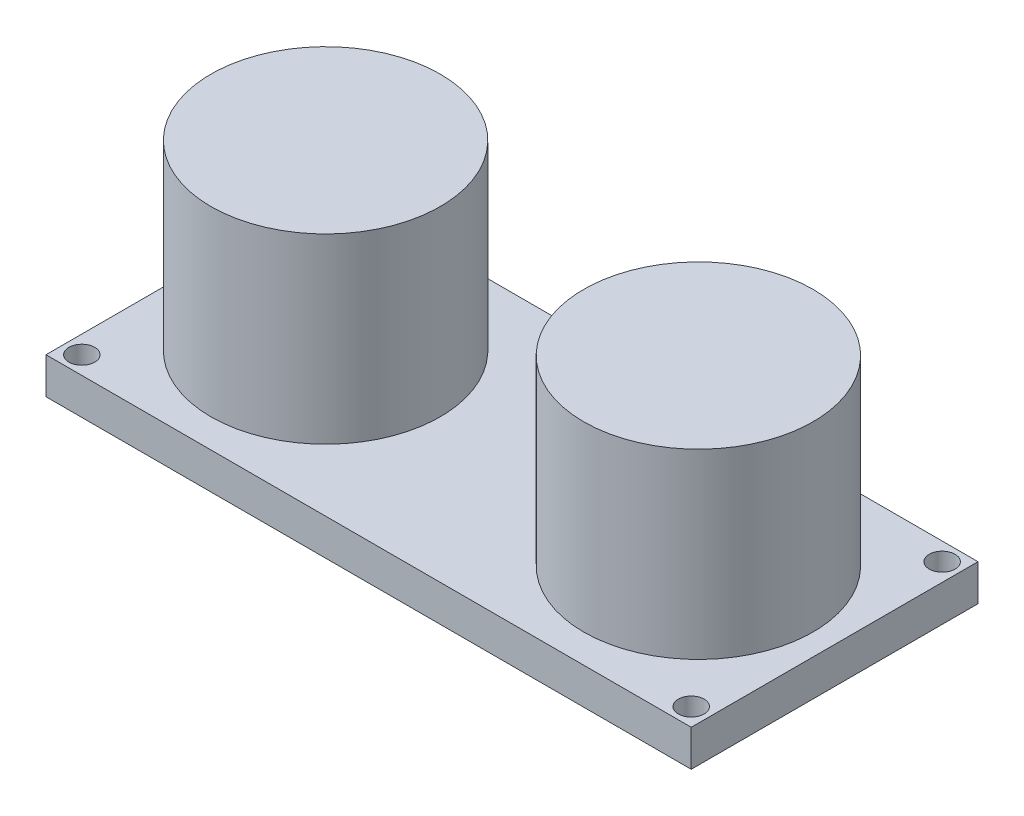
ISO-10303-21;
HEADER;
FILE_DESCRIPTION(('STEP AP214'),'2;1');
FILE_NAME('part.step','',(''),(''),'','','');
FILE_SCHEMA(('AUTOMOTIVE_DESIGN { 1 0 10303 214 1 1 1 1 }'));
ENDSEC;
DATA;
#1=APPLICATION_CONTEXT('core data for automotive mechanical design processes');
#2=APPLICATION_PROTOCOL_DEFINITION('international standard','automotive_design',2000,#1);
#3=PRODUCT_CONTEXT('',#1,'mechanical');
#4=PRODUCT('Part','Part','',(#3));
#5=PRODUCT_RELATED_PRODUCT_CATEGORY('part','',(#4));
#6=PRODUCT_DEFINITION_FORMATION('','',#4);
#7=PRODUCT_DEFINITION_CONTEXT('part definition',#1,'design');
#8=PRODUCT_DEFINITION('design','',#6,#7);
#9=PRODUCT_DEFINITION_SHAPE('','',#8);
#10=(LENGTH_UNIT() NAMED_UNIT(*) SI_UNIT(.MILLI.,.METRE.));
#11=(NAMED_UNIT(*) PLANE_ANGLE_UNIT() SI_UNIT($,.RADIAN.));
#12=(NAMED_UNIT(*) SI_UNIT($,.STERADIAN.) SOLID_ANGLE_UNIT());
#13=UNCERTAINTY_MEASURE_WITH_UNIT(LENGTH_MEASURE(1.E-05),#10,'distance_accuracy_value','');
#14=(GEOMETRIC_REPRESENTATION_CONTEXT(3) GLOBAL_UNCERTAINTY_ASSIGNED_CONTEXT((#13)) GLOBAL_UNIT_ASSIGNED_CONTEXT((#10,
#11,#12)) REPRESENTATION_CONTEXT('',''));
#15=CARTESIAN_POINT('',(0.,0.,0.));
#16=DIRECTION('',(0.,0.,1.));
#17=DIRECTION('',(1.,0.,0.));
#18=AXIS2_PLACEMENT_3D('',#15,#16,#17);
#19=CARTESIAN_POINT('',(0.,2.54,0.));
#20=DIRECTION('',(1.,0.,0.));
#21=DIRECTION('',(0.,0.,-1.));
#22=AXIS2_PLACEMENT_3D('',#19,#20,#21);
#23=PLANE('',#22);
#24=DIRECTION('',(0.,0.,1.));
#25=VECTOR('',#24,1.);
#26=CARTESIAN_POINT('',(0.,0.,0.));
#27=LINE('',#26,#25);
#28=CARTESIAN_POINT('',(0.,0.,-20.));
#29=VERTEX_POINT('',#28);
#30=CARTESIAN_POINT('',(0.,0.,0.));
#31=VERTEX_POINT('',#30);
#32=EDGE_CURVE('E111',#29,#31,#27,.T.);
#33=ORIENTED_EDGE('',*,*,#32,.T.);
#34=DIRECTION('',(0.,-1.,0.));
#35=VECTOR('',#34,1.);
#36=CARTESIAN_POINT('',(0.,2.54,0.));
#37=LINE('',#36,#35);
#38=CARTESIAN_POINT('',(0.,2.54,0.));
#39=VERTEX_POINT('',#38);
#40=EDGE_CURVE('E100',#39,#31,#37,.T.);
#41=ORIENTED_EDGE('',*,*,#40,.F.);
#42=DIRECTION('',(0.,0.,1.));
#43=VECTOR('',#42,1.);
#44=CARTESIAN_POINT('',(0.,2.54,0.));
#45=LINE('',#44,#43);
#46=CARTESIAN_POINT('',(0.,2.54,-20.));
#47=VERTEX_POINT('',#46);
#48=EDGE_CURVE('E92',#47,#39,#45,.T.);
#49=ORIENTED_EDGE('',*,*,#48,.F.);
#50=DIRECTION('',(0.,-1.,0.));
#51=VECTOR('',#50,1.);
#52=CARTESIAN_POINT('',(0.,2.54,-20.));
#53=LINE('',#52,#51);
#54=EDGE_CURVE('E107',#47,#29,#53,.T.);
#55=ORIENTED_EDGE('',*,*,#54,.T.);
#56=EDGE_LOOP('',(#33,#41,#49,#55));
#57=FACE_BOUND('',#56,.T.);
#58=ADVANCED_FACE('F39',(#57),#23,.F.);
#59=CARTESIAN_POINT('',(0.,2.54,0.));
#60=DIRECTION('',(0.,0.,-1.));
#61=DIRECTION('',(-1.,0.,0.));
#62=AXIS2_PLACEMENT_3D('',#59,#60,#61);
#63=PLANE('',#62);
#64=DIRECTION('',(1.,0.,0.));
#65=VECTOR('',#64,1.);
#66=CARTESIAN_POINT('',(0.,0.,0.));
#67=LINE('',#66,#65);
#68=CARTESIAN_POINT('',(45.,0.,0.));
#69=VERTEX_POINT('',#68);
#70=EDGE_CURVE('E98',#31,#69,#67,.T.);
#71=ORIENTED_EDGE('',*,*,#70,.T.);
#72=DIRECTION('',(0.,-1.,0.));
#73=VECTOR('',#72,1.);
#74=CARTESIAN_POINT('',(45.,2.54,0.));
#75=LINE('',#74,#73);
#76=CARTESIAN_POINT('',(45.,2.54,0.));
#77=VERTEX_POINT('',#76);
#78=EDGE_CURVE('E96',#77,#69,#75,.T.);
#79=ORIENTED_EDGE('',*,*,#78,.F.);
#80=DIRECTION('',(1.,0.,0.));
#81=VECTOR('',#80,1.);
#82=CARTESIAN_POINT('',(0.,2.54,0.));
#83=LINE('',#82,#81);
#84=EDGE_CURVE('E87',#39,#77,#83,.T.);
#85=ORIENTED_EDGE('',*,*,#84,.F.);
#86=ORIENTED_EDGE('',*,*,#40,.T.);
#87=EDGE_LOOP('',(#71,#79,#85,#86));
#88=FACE_BOUND('',#87,.T.);
#89=ADVANCED_FACE('F97',(#88),#63,.F.);
#90=CARTESIAN_POINT('',(45.,2.54,0.));
#91=DIRECTION('',(-1.,0.,0.));
#92=DIRECTION('',(0.,0.,1.));
#93=AXIS2_PLACEMENT_3D('',#90,#91,#92);
#94=PLANE('',#93);
#95=DIRECTION('',(0.,0.,-1.));
#96=VECTOR('',#95,1.);
#97=CARTESIAN_POINT('',(45.,0.,0.));
#98=LINE('',#97,#96);
#99=CARTESIAN_POINT('',(45.,0.,-20.));
#100=VERTEX_POINT('',#99);
#101=EDGE_CURVE('E73',#69,#100,#98,.T.);
#102=ORIENTED_EDGE('',*,*,#101,.T.);
#103=DIRECTION('',(0.,-1.,0.));
#104=VECTOR('',#103,1.);
#105=CARTESIAN_POINT('',(45.,2.54,-20.));
#106=LINE('',#105,#104);
#107=CARTESIAN_POINT('',(45.,2.54,-20.));
#108=VERTEX_POINT('',#107);
#109=EDGE_CURVE('E101',#108,#100,#106,.T.);
#110=ORIENTED_EDGE('',*,*,#109,.F.);
#111=DIRECTION('',(0.,0.,-1.));
#112=VECTOR('',#111,1.);
#113=CARTESIAN_POINT('',(45.,2.54,0.));
#114=LINE('',#113,#112);
#115=EDGE_CURVE('E90',#77,#108,#114,.T.);
#116=ORIENTED_EDGE('',*,*,#115,.F.);
#117=ORIENTED_EDGE('',*,*,#78,.T.);
#118=EDGE_LOOP('',(#102,#110,#116,#117));
#119=FACE_BOUND('',#118,.T.);
#120=ADVANCED_FACE('F103',(#119),#94,.F.);
#121=CARTESIAN_POINT('',(0.,2.54,-20.));
#122=DIRECTION('',(0.,0.,1.));
#123=DIRECTION('',(1.,0.,0.));
#124=AXIS2_PLACEMENT_3D('',#121,#122,#123);
#125=PLANE('',#124);
#126=DIRECTION('',(-1.,0.,0.));
#127=VECTOR('',#126,1.);
#128=CARTESIAN_POINT('',(0.,0.,-20.));
#129=LINE('',#128,#127);
#130=EDGE_CURVE('E79',#100,#29,#129,.T.);
#131=ORIENTED_EDGE('',*,*,#130,.T.);
#132=ORIENTED_EDGE('',*,*,#54,.F.);
#133=DIRECTION('',(-1.,0.,0.));
#134=VECTOR('',#133,1.);
#135=CARTESIAN_POINT('',(0.,2.54,-20.));
#136=LINE('',#135,#134);
#137=EDGE_CURVE('E56',#108,#47,#136,.T.);
#138=ORIENTED_EDGE('',*,*,#137,.F.);
#139=ORIENTED_EDGE('',*,*,#109,.T.);
#140=EDGE_LOOP('',(#131,#132,#138,#139));
#141=FACE_BOUND('',#140,.T.);
#142=ADVANCED_FACE('F136',(#141),#125,.F.);
#143=CARTESIAN_POINT('',(0.,2.54,0.));
#144=DIRECTION('',(0.,-1.,0.));
#145=DIRECTION('',(0.,0.,-1.));
#146=AXIS2_PLACEMENT_3D('',#143,#144,#145);
#147=PLANE('',#146);
#148=CARTESIAN_POINT('',(35.5,2.54,-10.));
#149=DIRECTION('',(0.,-1.,0.));
#150=DIRECTION('',(0.,0.,-1.));
#151=AXIS2_PLACEMENT_3D('',#148,#149,#150);
#152=CIRCLE('',#151,8.);
#153=CARTESIAN_POINT('',(35.5,2.54,-18.));
#154=VERTEX_POINT('',#153);
#155=EDGE_CURVE('E11',#154,#154,#152,.F.);
#156=ORIENTED_EDGE('',*,*,#155,.F.);
#157=EDGE_LOOP('',(#156));
#158=FACE_BOUND('',#157,.T.);
#159=CARTESIAN_POINT('',(9.5,2.54,-10.));
#160=DIRECTION('',(0.,-1.,0.));
#161=DIRECTION('',(0.,0.,-1.));
#162=AXIS2_PLACEMENT_3D('',#159,#160,#161);
#163=CIRCLE('',#162,8.);
#164=CARTESIAN_POINT('',(9.5,2.54,-18.));
#165=VERTEX_POINT('',#164);
#166=EDGE_CURVE('E48',#165,#165,#163,.F.);
#167=ORIENTED_EDGE('',*,*,#166,.F.);
#168=EDGE_LOOP('',(#167));
#169=FACE_BOUND('',#168,.T.);
#170=CARTESIAN_POINT('',(43.75,2.54,-18.75));
#171=DIRECTION('',(0.,1.,0.));
#172=DIRECTION('',(0.,0.,1.));
#173=AXIS2_PLACEMENT_3D('',#170,#171,#172);
#174=CIRCLE('',#173,0.899999999999998);
#175=CARTESIAN_POINT('',(43.75,2.54,-17.85));
#176=VERTEX_POINT('',#175);
#177=EDGE_CURVE('E142',#176,#176,#174,.T.);
#178=ORIENTED_EDGE('',*,*,#177,.F.);
#179=EDGE_LOOP('',(#178));
#180=FACE_BOUND('',#179,.T.);
#181=CARTESIAN_POINT('',(1.25,2.54,-18.75));
#182=DIRECTION('',(0.,1.,0.));
#183=DIRECTION('',(0.,0.,1.));
#184=AXIS2_PLACEMENT_3D('',#181,#182,#183);
#185=CIRCLE('',#184,0.9);
#186=CARTESIAN_POINT('',(1.25,2.54,-17.85));
#187=VERTEX_POINT('',#186);
#188=EDGE_CURVE('E146',#187,#187,#185,.T.);
#189=ORIENTED_EDGE('',*,*,#188,.F.);
#190=EDGE_LOOP('',(#189));
#191=FACE_BOUND('',#190,.T.);
#192=CARTESIAN_POINT('',(1.25,2.54,-1.25));
#193=DIRECTION('',(0.,1.,0.));
#194=DIRECTION('',(0.,0.,1.));
#195=AXIS2_PLACEMENT_3D('',#192,#193,#194);
#196=CIRCLE('',#195,0.9);
#197=CARTESIAN_POINT('',(1.25,2.54,-0.35));
#198=VERTEX_POINT('',#197);
#199=EDGE_CURVE('E150',#198,#198,#196,.T.);
#200=ORIENTED_EDGE('',*,*,#199,.F.);
#201=EDGE_LOOP('',(#200));
#202=FACE_BOUND('',#201,.T.);
#203=CARTESIAN_POINT('',(43.75,2.54,-1.25));
#204=DIRECTION('',(0.,1.,0.));
#205=DIRECTION('',(0.,0.,1.));
#206=AXIS2_PLACEMENT_3D('',#203,#204,#205);
#207=CIRCLE('',#206,0.899999999999998);
#208=CARTESIAN_POINT('',(43.75,2.54,-0.350000000000002));
#209=VERTEX_POINT('',#208);
#210=EDGE_CURVE('E153',#209,#209,#207,.T.);
#211=ORIENTED_EDGE('',*,*,#210,.F.);
#212=EDGE_LOOP('',(#211));
#213=FACE_BOUND('',#212,.T.);
#214=ORIENTED_EDGE('',*,*,#48,.T.);
#215=ORIENTED_EDGE('',*,*,#84,.T.);
#216=ORIENTED_EDGE('',*,*,#115,.T.);
#217=ORIENTED_EDGE('',*,*,#137,.T.);
#218=EDGE_LOOP('',(#214,#215,#216,#217));
#219=FACE_BOUND('',#218,.T.);
#220=ADVANCED_FACE('F88',(#158,#169,#180,#191,#202,#213,#219),#147,.F.);
#221=CARTESIAN_POINT('',(0.,0.,0.));
#222=DIRECTION('',(0.,-1.,0.));
#223=DIRECTION('',(0.,0.,-1.));
#224=AXIS2_PLACEMENT_3D('',#221,#222,#223);
#225=PLANE('',#224);
#226=CARTESIAN_POINT('',(43.75,0.,-18.75));
#227=DIRECTION('',(0.,1.,0.));
#228=DIRECTION('',(0.,0.,1.));
#229=AXIS2_PLACEMENT_3D('',#226,#227,#228);
#230=CIRCLE('',#229,0.899999999999998);
#231=CARTESIAN_POINT('',(43.75,0.,-17.85));
#232=VERTEX_POINT('',#231);
#233=EDGE_CURVE('E174',#232,#232,#230,.T.);
#234=ORIENTED_EDGE('',*,*,#233,.T.);
#235=EDGE_LOOP('',(#234));
#236=FACE_BOUND('',#235,.T.);
#237=CARTESIAN_POINT('',(1.25,0.,-18.75));
#238=DIRECTION('',(0.,1.,0.));
#239=DIRECTION('',(0.,0.,1.));
#240=AXIS2_PLACEMENT_3D('',#237,#238,#239);
#241=CIRCLE('',#240,0.9);
#242=CARTESIAN_POINT('',(1.25,0.,-17.85));
#243=VERTEX_POINT('',#242);
#244=EDGE_CURVE('E168',#243,#243,#241,.T.);
#245=ORIENTED_EDGE('',*,*,#244,.T.);
#246=EDGE_LOOP('',(#245));
#247=FACE_BOUND('',#246,.T.);
#248=CARTESIAN_POINT('',(1.25,0.,-1.25));
#249=DIRECTION('',(0.,1.,0.));
#250=DIRECTION('',(0.,0.,1.));
#251=AXIS2_PLACEMENT_3D('',#248,#249,#250);
#252=CIRCLE('',#251,0.9);
#253=CARTESIAN_POINT('',(1.25,0.,-0.35));
#254=VERTEX_POINT('',#253);
#255=EDGE_CURVE('E156',#254,#254,#252,.T.);
#256=ORIENTED_EDGE('',*,*,#255,.T.);
#257=EDGE_LOOP('',(#256));
#258=FACE_BOUND('',#257,.T.);
#259=CARTESIAN_POINT('',(43.75,0.,-1.25));
#260=DIRECTION('',(0.,1.,0.));
#261=DIRECTION('',(0.,0.,1.));
#262=AXIS2_PLACEMENT_3D('',#259,#260,#261);
#263=CIRCLE('',#262,0.899999999999998);
#264=CARTESIAN_POINT('',(43.75,0.,-0.350000000000002));
#265=VERTEX_POINT('',#264);
#266=EDGE_CURVE('E115',#265,#265,#263,.T.);
#267=ORIENTED_EDGE('',*,*,#266,.T.);
#268=EDGE_LOOP('',(#267));
#269=FACE_BOUND('',#268,.T.);
#270=ORIENTED_EDGE('',*,*,#32,.F.);
#271=ORIENTED_EDGE('',*,*,#130,.F.);
#272=ORIENTED_EDGE('',*,*,#101,.F.);
#273=ORIENTED_EDGE('',*,*,#70,.F.);
#274=EDGE_LOOP('',(#270,#271,#272,#273));
#275=FACE_BOUND('',#274,.T.);
#276=ADVANCED_FACE('F135',(#236,#247,#258,#269,#275),#225,.T.);
#277=CARTESIAN_POINT('',(43.75,2.54,-1.25));
#278=DIRECTION('',(0.,1.,0.));
#279=DIRECTION('',(0.,0.,1.));
#280=AXIS2_PLACEMENT_3D('',#277,#278,#279);
#281=CYLINDRICAL_SURFACE('',#280,0.899999999999998);
#282=ORIENTED_EDGE('',*,*,#266,.F.);
#283=EDGE_LOOP('',(#282));
#284=FACE_BOUND('',#283,.T.);
#285=ORIENTED_EDGE('',*,*,#210,.T.);
#286=EDGE_LOOP('',(#285));
#287=FACE_BOUND('',#286,.T.);
#288=ADVANCED_FACE('F212',(#284,#287),#281,.F.);
#289=CARTESIAN_POINT('',(1.25,2.54,-1.25));
#290=DIRECTION('',(0.,1.,0.));
#291=DIRECTION('',(0.,0.,1.));
#292=AXIS2_PLACEMENT_3D('',#289,#290,#291);
#293=CYLINDRICAL_SURFACE('',#292,0.9);
#294=ORIENTED_EDGE('',*,*,#255,.F.);
#295=EDGE_LOOP('',(#294));
#296=FACE_BOUND('',#295,.T.);
#297=ORIENTED_EDGE('',*,*,#199,.T.);
#298=EDGE_LOOP('',(#297));
#299=FACE_BOUND('',#298,.T.);
#300=ADVANCED_FACE('F218',(#296,#299),#293,.F.);
#301=CARTESIAN_POINT('',(1.25,2.54,-18.75));
#302=DIRECTION('',(0.,1.,0.));
#303=DIRECTION('',(0.,0.,1.));
#304=AXIS2_PLACEMENT_3D('',#301,#302,#303);
#305=CYLINDRICAL_SURFACE('',#304,0.9);
#306=ORIENTED_EDGE('',*,*,#244,.F.);
#307=EDGE_LOOP('',(#306));
#308=FACE_BOUND('',#307,.T.);
#309=ORIENTED_EDGE('',*,*,#188,.T.);
#310=EDGE_LOOP('',(#309));
#311=FACE_BOUND('',#310,.T.);
#312=ADVANCED_FACE('F276',(#308,#311),#305,.F.);
#313=CARTESIAN_POINT('',(43.75,2.54,-18.75));
#314=DIRECTION('',(0.,1.,0.));
#315=DIRECTION('',(0.,0.,1.));
#316=AXIS2_PLACEMENT_3D('',#313,#314,#315);
#317=CYLINDRICAL_SURFACE('',#316,0.899999999999998);
#318=ORIENTED_EDGE('',*,*,#233,.F.);
#319=EDGE_LOOP('',(#318));
#320=FACE_BOUND('',#319,.T.);
#321=ORIENTED_EDGE('',*,*,#177,.T.);
#322=EDGE_LOOP('',(#321));
#323=FACE_BOUND('',#322,.T.);
#324=ADVANCED_FACE('F245',(#320,#323),#317,.F.);
#325=CARTESIAN_POINT('',(9.5,15.24,-10.));
#326=DIRECTION('',(0.,-1.,0.));
#327=DIRECTION('',(0.,0.,-1.));
#328=AXIS2_PLACEMENT_3D('',#325,#326,#327);
#329=CYLINDRICAL_SURFACE('',#328,8.);
#330=CARTESIAN_POINT('',(9.5,15.24,-10.));
#331=DIRECTION('',(0.,1.,0.));
#332=DIRECTION('',(0.,0.,1.));
#333=AXIS2_PLACEMENT_3D('',#330,#331,#332);
#334=CIRCLE('',#333,8.);
#335=CARTESIAN_POINT('',(9.5,15.24,-2.));
#336=VERTEX_POINT('',#335);
#337=EDGE_CURVE('E180',#336,#336,#334,.T.);
#338=ORIENTED_EDGE('',*,*,#337,.F.);
#339=EDGE_LOOP('',(#338));
#340=FACE_BOUND('',#339,.T.);
#341=ORIENTED_EDGE('',*,*,#166,.T.);
#342=EDGE_LOOP('',(#341));
#343=FACE_BOUND('',#342,.T.);
#344=ADVANCED_FACE('F131',(#340,#343),#329,.T.);
#345=CARTESIAN_POINT('',(9.5,15.24,-10.));
#346=DIRECTION('',(0.,1.,0.));
#347=DIRECTION('',(0.,0.,1.));
#348=AXIS2_PLACEMENT_3D('',#345,#346,#347);
#349=PLANE('',#348);
#350=ORIENTED_EDGE('',*,*,#337,.T.);
#351=EDGE_LOOP('',(#350));
#352=FACE_BOUND('',#351,.T.);
#353=ADVANCED_FACE('F194',(#352),#349,.T.);
#354=CARTESIAN_POINT('',(35.5,15.24,-10.));
#355=DIRECTION('',(0.,-1.,0.));
#356=DIRECTION('',(0.,0.,-1.));
#357=AXIS2_PLACEMENT_3D('',#354,#355,#356);
#358=CYLINDRICAL_SURFACE('',#357,8.);
#359=CARTESIAN_POINT('',(35.5,15.24,-10.));
#360=DIRECTION('',(0.,1.,0.));
#361=DIRECTION('',(0.,0.,1.));
#362=AXIS2_PLACEMENT_3D('',#359,#360,#361);
#363=CIRCLE('',#362,8.);
#364=CARTESIAN_POINT('',(35.5,15.24,-2.));
#365=VERTEX_POINT('',#364);
#366=EDGE_CURVE('E184',#365,#365,#363,.T.);
#367=ORIENTED_EDGE('',*,*,#366,.F.);
#368=EDGE_LOOP('',(#367));
#369=FACE_BOUND('',#368,.T.);
#370=ORIENTED_EDGE('',*,*,#155,.T.);
#371=EDGE_LOOP('',(#370));
#372=FACE_BOUND('',#371,.T.);
#373=ADVANCED_FACE('F191',(#369,#372),#358,.T.);
#374=CARTESIAN_POINT('',(35.5,15.24,-10.));
#375=DIRECTION('',(0.,1.,0.));
#376=DIRECTION('',(0.,0.,1.));
#377=AXIS2_PLACEMENT_3D('',#374,#375,#376);
#378=PLANE('',#377);
#379=ORIENTED_EDGE('',*,*,#366,.T.);
#380=EDGE_LOOP('',(#379));
#381=FACE_BOUND('',#380,.T.);
#382=ADVANCED_FACE('F189',(#381),#378,.T.);
#383=CLOSED_SHELL('',(#58,#89,#120,#142,#220,#276,#288,#300,#312,#324,#344,#353,#373,#382));
#384=MANIFOLD_SOLID_BREP('B2',#383);
#385=ADVANCED_BREP_SHAPE_REPRESENTATION('',(#18,#384),#14);
#386=SHAPE_DEFINITION_REPRESENTATION(#9,#385);
ENDSEC;
END-ISO-10303-21;
